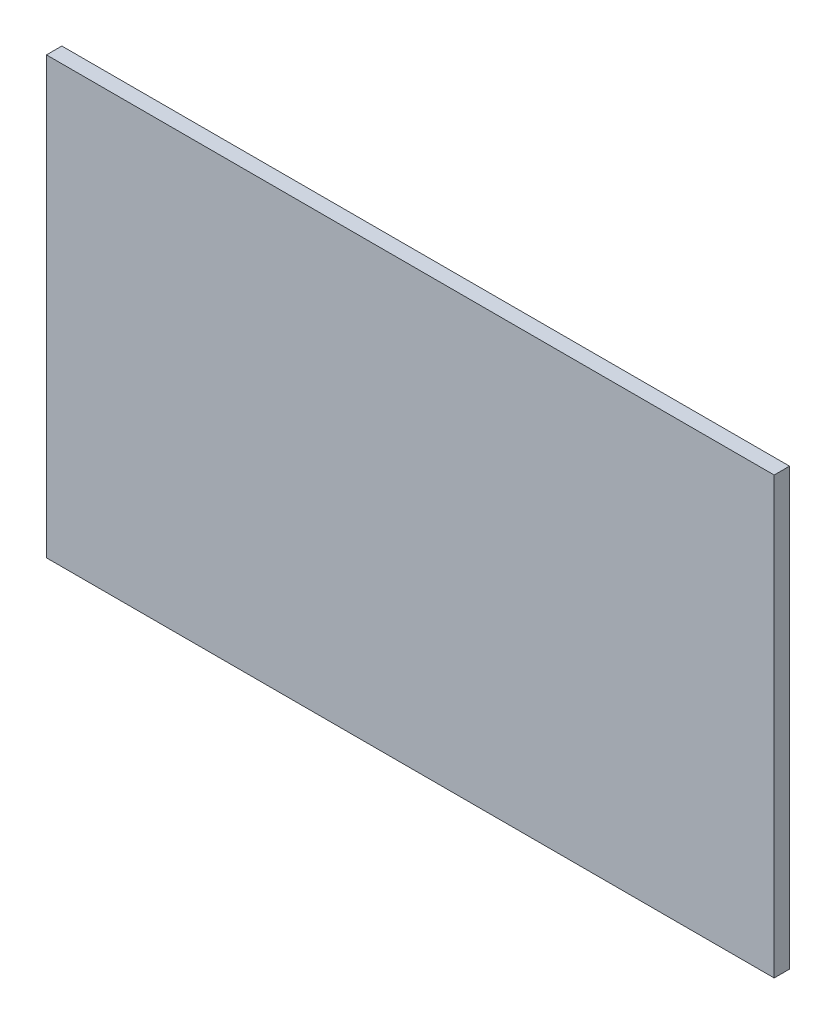
ISO-10303-21;
HEADER;
FILE_DESCRIPTION(('STEP AP214'),'2;1');
FILE_NAME('part.step','',(''),(''),'','','');
FILE_SCHEMA(('AUTOMOTIVE_DESIGN { 1 0 10303 214 1 1 1 1 }'));
ENDSEC;
DATA;
#1=APPLICATION_CONTEXT('core data for automotive mechanical design processes');
#2=APPLICATION_PROTOCOL_DEFINITION('international standard','automotive_design',2000,#1);
#3=PRODUCT_CONTEXT('',#1,'mechanical');
#4=PRODUCT('Part','Part','',(#3));
#5=PRODUCT_RELATED_PRODUCT_CATEGORY('part','',(#4));
#6=PRODUCT_DEFINITION_FORMATION('','',#4);
#7=PRODUCT_DEFINITION_CONTEXT('part definition',#1,'design');
#8=PRODUCT_DEFINITION('design','',#6,#7);
#9=PRODUCT_DEFINITION_SHAPE('','',#8);
#10=(LENGTH_UNIT() NAMED_UNIT(*) SI_UNIT(.MILLI.,.METRE.));
#11=(NAMED_UNIT(*) PLANE_ANGLE_UNIT() SI_UNIT($,.RADIAN.));
#12=(NAMED_UNIT(*) SI_UNIT($,.STERADIAN.) SOLID_ANGLE_UNIT());
#13=UNCERTAINTY_MEASURE_WITH_UNIT(LENGTH_MEASURE(1.E-05),#10,'distance_accuracy_value','');
#14=(GEOMETRIC_REPRESENTATION_CONTEXT(3) GLOBAL_UNCERTAINTY_ASSIGNED_CONTEXT((#13)) GLOBAL_UNIT_ASSIGNED_CONTEXT((#10,
#11,#12)) REPRESENTATION_CONTEXT('',''));
#15=CARTESIAN_POINT('',(0.,0.,0.));
#16=DIRECTION('',(0.,0.,1.));
#17=DIRECTION('',(1.,0.,0.));
#18=AXIS2_PLACEMENT_3D('',#15,#16,#17);
#19=CARTESIAN_POINT('',(-75.175,-45.,3.175));
#20=DIRECTION('',(1.,0.,0.));
#21=DIRECTION('',(0.,0.,-1.));
#22=AXIS2_PLACEMENT_3D('',#19,#20,#21);
#23=PLANE('',#22);
#24=DIRECTION('',(0.,-1.,0.));
#25=VECTOR('',#24,1.);
#26=CARTESIAN_POINT('',(-75.175,-45.,0.));
#27=LINE('',#26,#25);
#28=CARTESIAN_POINT('',(-75.175,45.,0.));
#29=VERTEX_POINT('',#28);
#30=CARTESIAN_POINT('',(-75.175,-45.,0.));
#31=VERTEX_POINT('',#30);
#32=EDGE_CURVE('E98',#29,#31,#27,.T.);
#33=ORIENTED_EDGE('',*,*,#32,.T.);
#34=DIRECTION('',(0.,0.,-1.));
#35=VECTOR('',#34,1.);
#36=CARTESIAN_POINT('',(-75.175,-45.,3.175));
#37=LINE('',#36,#35);
#38=CARTESIAN_POINT('',(-75.175,-45.,3.175));
#39=VERTEX_POINT('',#38);
#40=EDGE_CURVE('E11',#39,#31,#37,.T.);
#41=ORIENTED_EDGE('',*,*,#40,.F.);
#42=DIRECTION('',(0.,-1.,0.));
#43=VECTOR('',#42,1.);
#44=CARTESIAN_POINT('',(-75.175,-45.,3.175));
#45=LINE('',#44,#43);
#46=CARTESIAN_POINT('',(-75.175,45.,3.175));
#47=VERTEX_POINT('',#46);
#48=EDGE_CURVE('E86',#47,#39,#45,.T.);
#49=ORIENTED_EDGE('',*,*,#48,.F.);
#50=DIRECTION('',(0.,0.,-1.));
#51=VECTOR('',#50,1.);
#52=CARTESIAN_POINT('',(-75.175,45.,3.175));
#53=LINE('',#52,#51);
#54=EDGE_CURVE('E94',#47,#29,#53,.T.);
#55=ORIENTED_EDGE('',*,*,#54,.T.);
#56=EDGE_LOOP('',(#33,#41,#49,#55));
#57=FACE_BOUND('',#56,.T.);
#58=ADVANCED_FACE('F35',(#57),#23,.F.);
#59=CARTESIAN_POINT('',(-75.175,-45.,3.175));
#60=DIRECTION('',(0.,1.,0.));
#61=DIRECTION('',(0.,0.,1.));
#62=AXIS2_PLACEMENT_3D('',#59,#60,#61);
#63=PLANE('',#62);
#64=DIRECTION('',(1.,0.,0.));
#65=VECTOR('',#64,1.);
#66=CARTESIAN_POINT('',(-75.175,-45.,0.));
#67=LINE('',#66,#65);
#68=CARTESIAN_POINT('',(75.175,-45.,0.));
#69=VERTEX_POINT('',#68);
#70=EDGE_CURVE('E90',#31,#69,#67,.T.);
#71=ORIENTED_EDGE('',*,*,#70,.T.);
#72=DIRECTION('',(0.,0.,-1.));
#73=VECTOR('',#72,1.);
#74=CARTESIAN_POINT('',(75.175,-45.,3.175));
#75=LINE('',#74,#73);
#76=CARTESIAN_POINT('',(75.175,-45.,3.175));
#77=VERTEX_POINT('',#76);
#78=EDGE_CURVE('E43',#77,#69,#75,.T.);
#79=ORIENTED_EDGE('',*,*,#78,.F.);
#80=DIRECTION('',(1.,0.,0.));
#81=VECTOR('',#80,1.);
#82=CARTESIAN_POINT('',(-75.175,-45.,3.175));
#83=LINE('',#82,#81);
#84=EDGE_CURVE('E81',#39,#77,#83,.T.);
#85=ORIENTED_EDGE('',*,*,#84,.F.);
#86=ORIENTED_EDGE('',*,*,#40,.T.);
#87=EDGE_LOOP('',(#71,#79,#85,#86));
#88=FACE_BOUND('',#87,.T.);
#89=ADVANCED_FACE('F89',(#88),#63,.F.);
#90=CARTESIAN_POINT('',(75.175,-45.,3.175));
#91=DIRECTION('',(-1.,0.,0.));
#92=DIRECTION('',(0.,0.,1.));
#93=AXIS2_PLACEMENT_3D('',#90,#91,#92);
#94=PLANE('',#93);
#95=DIRECTION('',(0.,1.,0.));
#96=VECTOR('',#95,1.);
#97=CARTESIAN_POINT('',(75.175,-45.,0.));
#98=LINE('',#97,#96);
#99=CARTESIAN_POINT('',(75.175,45.,0.));
#100=VERTEX_POINT('',#99);
#101=EDGE_CURVE('E68',#69,#100,#98,.T.);
#102=ORIENTED_EDGE('',*,*,#101,.T.);
#103=DIRECTION('',(0.,0.,-1.));
#104=VECTOR('',#103,1.);
#105=CARTESIAN_POINT('',(75.175,45.,3.175));
#106=LINE('',#105,#104);
#107=CARTESIAN_POINT('',(75.175,45.,3.175));
#108=VERTEX_POINT('',#107);
#109=EDGE_CURVE('E91',#108,#100,#106,.T.);
#110=ORIENTED_EDGE('',*,*,#109,.F.);
#111=DIRECTION('',(0.,1.,0.));
#112=VECTOR('',#111,1.);
#113=CARTESIAN_POINT('',(75.175,-45.,3.175));
#114=LINE('',#113,#112);
#115=EDGE_CURVE('E84',#77,#108,#114,.T.);
#116=ORIENTED_EDGE('',*,*,#115,.F.);
#117=ORIENTED_EDGE('',*,*,#78,.T.);
#118=EDGE_LOOP('',(#102,#110,#116,#117));
#119=FACE_BOUND('',#118,.T.);
#120=ADVANCED_FACE('F92',(#119),#94,.F.);
#121=CARTESIAN_POINT('',(-75.175,45.,3.175));
#122=DIRECTION('',(0.,-1.,0.));
#123=DIRECTION('',(0.,0.,-1.));
#124=AXIS2_PLACEMENT_3D('',#121,#122,#123);
#125=PLANE('',#124);
#126=DIRECTION('',(-1.,0.,0.));
#127=VECTOR('',#126,1.);
#128=CARTESIAN_POINT('',(-75.175,45.,0.));
#129=LINE('',#128,#127);
#130=EDGE_CURVE('E74',#100,#29,#129,.T.);
#131=ORIENTED_EDGE('',*,*,#130,.T.);
#132=ORIENTED_EDGE('',*,*,#54,.F.);
#133=DIRECTION('',(-1.,0.,0.));
#134=VECTOR('',#133,1.);
#135=CARTESIAN_POINT('',(-75.175,45.,3.175));
#136=LINE('',#135,#134);
#137=EDGE_CURVE('E51',#108,#47,#136,.T.);
#138=ORIENTED_EDGE('',*,*,#137,.F.);
#139=ORIENTED_EDGE('',*,*,#109,.T.);
#140=EDGE_LOOP('',(#131,#132,#138,#139));
#141=FACE_BOUND('',#140,.T.);
#142=ADVANCED_FACE('F105',(#141),#125,.F.);
#143=CARTESIAN_POINT('',(0.,0.,3.175));
#144=DIRECTION('',(0.,0.,-1.));
#145=DIRECTION('',(-1.,0.,0.));
#146=AXIS2_PLACEMENT_3D('',#143,#144,#145);
#147=PLANE('',#146);
#148=ORIENTED_EDGE('',*,*,#48,.T.);
#149=ORIENTED_EDGE('',*,*,#84,.T.);
#150=ORIENTED_EDGE('',*,*,#115,.T.);
#151=ORIENTED_EDGE('',*,*,#137,.T.);
#152=EDGE_LOOP('',(#148,#149,#150,#151));
#153=FACE_BOUND('',#152,.T.);
#154=ADVANCED_FACE('F82',(#153),#147,.F.);
#155=CARTESIAN_POINT('',(0.,0.,0.));
#156=DIRECTION('',(0.,0.,-1.));
#157=DIRECTION('',(-1.,0.,0.));
#158=AXIS2_PLACEMENT_3D('',#155,#156,#157);
#159=PLANE('',#158);
#160=ORIENTED_EDGE('',*,*,#32,.F.);
#161=ORIENTED_EDGE('',*,*,#130,.F.);
#162=ORIENTED_EDGE('',*,*,#101,.F.);
#163=ORIENTED_EDGE('',*,*,#70,.F.);
#164=EDGE_LOOP('',(#160,#161,#162,#163));
#165=FACE_BOUND('',#164,.T.);
#166=ADVANCED_FACE('F108',(#165),#159,.T.);
#167=CLOSED_SHELL('',(#58,#89,#120,#142,#154,#166));
#168=MANIFOLD_SOLID_BREP('B2',#167);
#169=ADVANCED_BREP_SHAPE_REPRESENTATION('',(#18,#168),#14);
#170=SHAPE_DEFINITION_REPRESENTATION(#9,#169);
ENDSEC;
END-ISO-10303-21;
